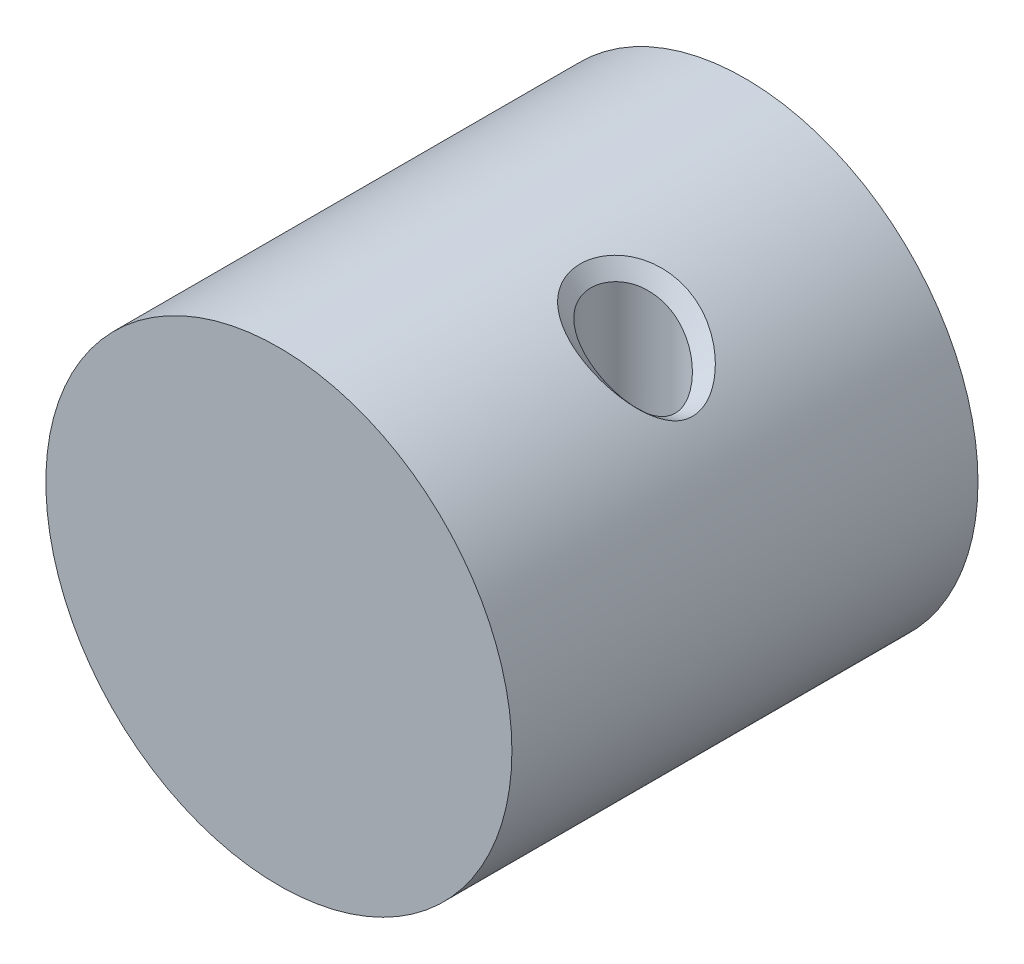
ISO-10303-21;
HEADER;
FILE_DESCRIPTION(('STEP AP214'),'2;1');
FILE_NAME('part.step','',(''),(''),'','','');
FILE_SCHEMA(('AUTOMOTIVE_DESIGN { 1 0 10303 214 1 1 1 1 }'));
ENDSEC;
DATA;
#1=APPLICATION_CONTEXT('core data for automotive mechanical design processes');
#2=APPLICATION_PROTOCOL_DEFINITION('international standard','automotive_design',2000,#1);
#3=PRODUCT_CONTEXT('',#1,'mechanical');
#4=PRODUCT('Part','Part','',(#3));
#5=PRODUCT_RELATED_PRODUCT_CATEGORY('part','',(#4));
#6=PRODUCT_DEFINITION_FORMATION('','',#4);
#7=PRODUCT_DEFINITION_CONTEXT('part definition',#1,'design');
#8=PRODUCT_DEFINITION('design','',#6,#7);
#9=PRODUCT_DEFINITION_SHAPE('','',#8);
#10=(LENGTH_UNIT() NAMED_UNIT(*) SI_UNIT(.MILLI.,.METRE.));
#11=(NAMED_UNIT(*) PLANE_ANGLE_UNIT() SI_UNIT($,.RADIAN.));
#12=(NAMED_UNIT(*) SI_UNIT($,.STERADIAN.) SOLID_ANGLE_UNIT());
#13=UNCERTAINTY_MEASURE_WITH_UNIT(LENGTH_MEASURE(1.E-05),#10,'distance_accuracy_value','');
#14=(GEOMETRIC_REPRESENTATION_CONTEXT(3) GLOBAL_UNCERTAINTY_ASSIGNED_CONTEXT((#13)) GLOBAL_UNIT_ASSIGNED_CONTEXT((#10,
#11,#12)) REPRESENTATION_CONTEXT('',''));
#15=CARTESIAN_POINT('',(0.,0.,0.));
#16=DIRECTION('',(0.,0.,1.));
#17=DIRECTION('',(1.,0.,0.));
#18=AXIS2_PLACEMENT_3D('',#15,#16,#17);
#19=CARTESIAN_POINT('',(0.,0.,25.));
#20=DIRECTION('',(0.,0.,-1.));
#21=DIRECTION('',(-1.,0.,0.));
#22=AXIS2_PLACEMENT_3D('',#19,#20,#21);
#23=CYLINDRICAL_SURFACE('',#22,25.);
#24=CARTESIAN_POINT('',(7.30974347389454,23.9074810539684,-1.24376962722106E-12));
#25=CARTESIAN_POINT('',(7.30997237631376,23.9074489383056,0.0870397648575998));
#26=CARTESIAN_POINT('',(7.32123338055778,23.9043034709858,0.52264136359775));
#27=CARTESIAN_POINT('',(7.44344578986285,23.8678399603276,1.39253136225855));
#28=CARTESIAN_POINT('',(7.85089980467598,23.7374933993846,2.55323139110753));
#29=CARTESIAN_POINT('',(8.54671682226728,23.498579120886,3.64869349988629));
#30=CARTESIAN_POINT('',(9.73966411055315,23.0430100764837,4.85972485626475));
#31=CARTESIAN_POINT('',(11.209666904177,22.3749055107022,5.61829197663956));
#32=CARTESIAN_POINT('',(12.7067551164635,21.5426808093991,5.92362472628961));
#33=CARTESIAN_POINT('',(13.8141062793869,20.8506369663582,5.94409809492801));
#34=CARTESIAN_POINT('',(14.8769847403961,20.1049025569509,5.77413626173053));
#35=CARTESIAN_POINT('',(15.8728467133326,19.3279248856483,5.42937652514873));
#36=CARTESIAN_POINT('',(16.784878474631,18.5396426797266,4.92363591809385));
#37=CARTESIAN_POINT('',(17.6043072601355,17.7616728164733,4.26327406903687));
#38=CARTESIAN_POINT('',(18.3123147244414,17.0282160079082,3.45039745312376));
#39=CARTESIAN_POINT('',(18.8855507499328,16.3868322107932,2.46029547781179));
#40=CARTESIAN_POINT('',(19.2934933996321,15.8998723149709,1.29961660346669));
#41=CARTESIAN_POINT('',(19.4092292344142,15.7574088157962,0.206099138749576));
#42=CARTESIAN_POINT('',(19.3574012672717,15.821089437367,-0.667258563429989));
#43=CARTESIAN_POINT('',(19.2511348847713,15.9499351921975,-1.30345965664715));
#44=CARTESIAN_POINT('',(19.0822860054682,16.1521258138773,-1.90275451782634));
#45=CARTESIAN_POINT('',(18.7851289334235,16.4994116252848,-2.64672215248969));
#46=CARTESIAN_POINT('',(18.3000442117225,17.0415254068003,-3.46235160000543));
#47=CARTESIAN_POINT('',(17.587119207816,17.778294995576,-4.27748174698293));
#48=CARTESIAN_POINT('',(16.7653194531404,18.5572859343365,-4.93554304195478));
#49=CARTESIAN_POINT('',(15.8515668608563,19.3456622093994,-5.44354824696945));
#50=CARTESIAN_POINT('',(14.8567782341363,20.119744531525,-5.78897588203163));
#51=CARTESIAN_POINT('',(13.7933461605968,20.8646312616614,-5.95111031519978));
#52=CARTESIAN_POINT('',(12.6812664193206,21.5573719787848,-5.9204383196832));
#53=CARTESIAN_POINT('',(11.5545598836946,22.1819820539428,-5.68226215537604));
#54=CARTESIAN_POINT('',(10.4472474271054,22.7224768581825,-5.22188408217247));
#55=CARTESIAN_POINT('',(9.4168926949122,23.1660704723504,-4.53055930557927));
#56=CARTESIAN_POINT('',(8.52631007092828,23.5063919735534,-3.627546765581));
#57=CARTESIAN_POINT('',(7.84400020171004,23.7397677836326,-2.53280636927204));
#58=CARTESIAN_POINT('',(7.43753548156944,23.8686113163364,-1.3837820937957));
#59=CARTESIAN_POINT('',(7.31858929434596,23.9046589116354,-0.521849834992076));
#60=CARTESIAN_POINT('',(7.30951457147532,23.9075131696311,-0.0870397648600858));
#61=CARTESIAN_POINT('',(7.30974347389454,23.9074810539684,-1.24376962722106E-12));
#62=B_SPLINE_CURVE_WITH_KNOTS('',3,(#24,#25,#26,#27,#28,#29,#30,#31,#32,#33,#34,#35,#36,#37,#38,
#39,#40,#41,#42,#43,#44,#45,#46,#47,#48,#49,#50,#51,#52,#53,#54,#55,#56,#57,#58,#59,#60,#61),
.UNSPECIFIED.,.T.,.F.,(4,1,1,1,1,1,1,1,1,1,1,1,1,1,1,1,1,1,1,1,1,1,1,1,1,1,1,1,1,1,1,1,1,1,1,4),
(0.,0.00625000000000009,0.03125,0.0625,0.09375,0.125,0.1875,0.21875,0.25,0.28125,0.3125,0.34375,
0.375,0.40625,0.4375,0.46875,0.5,0.515625,0.53125,0.546875,0.5625,0.59375,0.625,0.65625,0.6875,
0.71875,0.75,0.78125,0.8125,0.84375,0.875,0.90625,0.9375,0.96875,0.99375,1.),.UNSPECIFIED.);
#63=CARTESIAN_POINT('',(7.30974347389454,23.9074810539684,-1.24376962722106E-12));
#64=VERTEX_POINT('',#63);
#65=EDGE_CURVE('E56',#64,#64,#62,.F.);
#66=ORIENTED_EDGE('',*,*,#65,.T.);
#67=EDGE_LOOP('',(#66));
#68=FACE_BOUND('',#67,.T.);
#69=CARTESIAN_POINT('',(0.,0.,-25.));
#70=DIRECTION('',(0.,0.,1.));
#71=DIRECTION('',(1.,0.,0.));
#72=AXIS2_PLACEMENT_3D('',#69,#70,#71);
#73=CIRCLE('',#72,25.);
#74=CARTESIAN_POINT('',(25.,0.,-25.));
#75=VERTEX_POINT('',#74);
#76=EDGE_CURVE('E78',#75,#75,#73,.T.);
#77=ORIENTED_EDGE('',*,*,#76,.T.);
#78=EDGE_LOOP('',(#77));
#79=FACE_BOUND('',#78,.T.);
#80=CARTESIAN_POINT('',(0.,0.,25.));
#81=DIRECTION('',(0.,0.,1.));
#82=DIRECTION('',(1.,0.,0.));
#83=AXIS2_PLACEMENT_3D('',#80,#81,#82);
#84=CIRCLE('',#83,25.);
#85=CARTESIAN_POINT('',(25.,0.,25.));
#86=VERTEX_POINT('',#85);
#87=EDGE_CURVE('E73',#86,#86,#84,.T.);
#88=ORIENTED_EDGE('',*,*,#87,.F.);
#89=EDGE_LOOP('',(#88));
#90=FACE_BOUND('',#89,.T.);
#91=ADVANCED_FACE('F45',(#68,#79,#90),#23,.T.);
#92=CARTESIAN_POINT('',(0.,0.,25.));
#93=DIRECTION('',(0.,0.,1.));
#94=DIRECTION('',(1.,0.,0.));
#95=AXIS2_PLACEMENT_3D('',#92,#93,#94);
#96=PLANE('',#95);
#97=ORIENTED_EDGE('',*,*,#87,.T.);
#98=EDGE_LOOP('',(#97));
#99=FACE_BOUND('',#98,.T.);
#100=ADVANCED_FACE('F119',(#99),#96,.T.);
#101=CARTESIAN_POINT('',(0.,0.,-25.));
#102=DIRECTION('',(0.,0.,1.));
#103=DIRECTION('',(1.,0.,0.));
#104=AXIS2_PLACEMENT_3D('',#101,#102,#103);
#105=PLANE('',#104);
#106=ORIENTED_EDGE('',*,*,#76,.F.);
#107=EDGE_LOOP('',(#106));
#108=FACE_BOUND('',#107,.T.);
#109=ADVANCED_FACE('F118',(#108),#105,.F.);
#110=CARTESIAN_POINT('',(13.,0.,0.));
#111=DIRECTION('',(0.,1.,0.));
#112=DIRECTION('',(0.,0.,1.));
#113=AXIS2_PLACEMENT_3D('',#110,#111,#112);
#114=PLANE('',#113);
#115=CARTESIAN_POINT('',(13.,0.,0.));
#116=DIRECTION('',(0.,1.,0.));
#117=DIRECTION('',(0.,0.,1.));
#118=AXIS2_PLACEMENT_3D('',#115,#116,#117);
#119=CIRCLE('',#118,4.5);
#120=CARTESIAN_POINT('',(13.,0.,4.5));
#121=VERTEX_POINT('',#120);
#122=EDGE_CURVE('E66',#121,#121,#119,.T.);
#123=ORIENTED_EDGE('',*,*,#122,.T.);
#124=EDGE_LOOP('',(#123));
#125=FACE_BOUND('',#124,.T.);
#126=ADVANCED_FACE('F108',(#125),#114,.T.);
#127=CARTESIAN_POINT('',(13.,50.,0.));
#128=DIRECTION('',(0.,-1.,0.));
#129=DIRECTION('',(0.,0.,-1.));
#130=AXIS2_PLACEMENT_3D('',#127,#128,#129);
#131=CYLINDRICAL_SURFACE('',#130,4.5);
#132=CARTESIAN_POINT('',(8.5,22.2997278050381,9.47569659456166E-11));
#133=CARTESIAN_POINT('',(8.50026074510643,22.2997214324945,-0.0673114997222603));
#134=CARTESIAN_POINT('',(8.51009425155425,22.2964039345832,-0.404574444659071));
#135=CARTESIAN_POINT('',(8.6127308262808,22.2567806743789,-1.08166616192264));
#136=CARTESIAN_POINT('',(8.94203659366738,22.1168480063478,-1.99081504935145));
#137=CARTESIAN_POINT('',(9.47868169979536,21.8662944834,-2.85816728962487));
#138=CARTESIAN_POINT('',(10.1662895945261,21.5112564584609,-3.54520444669953));
#139=CARTESIAN_POINT('',(10.9542913744986,21.0655601765073,-4.04171840064922));
#140=CARTESIAN_POINT('',(11.7922148380865,20.5469874367108,-4.36293110546316));
#141=CARTESIAN_POINT('',(12.6184669398875,19.9758190229368,-4.50850152655662));
#142=CARTESIAN_POINT('',(13.4175703321254,19.3600645716021,-4.50352801745533));
#143=CARTESIAN_POINT('',(14.1819690557396,18.710158471296,-4.36459878462216));
#144=CARTESIAN_POINT('',(14.9052290455241,18.0541498183849,-4.10074366001933));
#145=CARTESIAN_POINT('',(15.5723434007278,17.3948633878245,-3.71893352670372));
#146=CARTESIAN_POINT('',(16.1702713773103,16.7484959382495,-3.22563601766325));
#147=CARTESIAN_POINT('',(16.6957970983322,16.1366414045896,-2.61195387624947));
#148=CARTESIAN_POINT('',(17.0579603326303,15.6972209620749,-1.98604263952447));
#149=CARTESIAN_POINT('',(17.2809804005135,15.4093711406675,-1.41277212388677));
#150=CARTESIAN_POINT('',(17.4085897303453,15.2391981981506,-0.950455794190515));
#151=CARTESIAN_POINT('',(17.4852730005658,15.1363332217353,-0.460083426964195));
#152=CARTESIAN_POINT('',(17.5147902036148,15.1022876627323,0.219739814326475));
#153=CARTESIAN_POINT('',(17.4111366536488,15.2449452826154,1.06443808393912));
#154=CARTESIAN_POINT('',(17.08959470529,15.6558419304743,1.94621947771917));
#155=CARTESIAN_POINT('',(16.6430882929585,16.1946578970715,2.68477022099446));
#156=CARTESIAN_POINT('',(16.1107717886495,16.8089584866172,3.28272066879391));
#157=CARTESIAN_POINT('',(15.5047740050962,17.4630550414957,3.76463086990335));
#158=CARTESIAN_POINT('',(14.8337112512853,18.124817169969,4.13322448684324));
#159=CARTESIAN_POINT('',(14.1067687622773,18.7852207348662,4.3843688363035));
#160=CARTESIAN_POINT('',(13.3357800939911,19.4283914639729,4.5114309617271));
#161=CARTESIAN_POINT('',(12.5265162632194,20.0406424698403,4.4996005620401));
#162=CARTESIAN_POINT('',(11.4250105198979,20.7943526289399,4.28295444640308));
#163=CARTESIAN_POINT('',(10.3397388230225,21.4307708753595,3.72523333836452));
#164=CARTESIAN_POINT('',(9.44013692705676,21.8829826972436,2.80893720516574));
#165=CARTESIAN_POINT('',(8.91152572274373,22.1250925678431,1.96947366654537));
#166=CARTESIAN_POINT('',(8.60096588439658,22.2583084307613,1.0722012438494));
#167=CARTESIAN_POINT('',(8.5067049509011,22.2965660859348,0.403712784913258));
#168=CARTESIAN_POINT('',(8.49973925489357,22.2997341775818,0.0673114999117754));
#169=CARTESIAN_POINT('',(8.5,22.2997278050381,9.47569659456166E-11));
#170=B_SPLINE_CURVE_WITH_KNOTS('',3,(#132,#133,#134,#135,#136,#137,#138,#139,#140,#141,#142,
#143,#144,#145,#146,#147,#148,#149,#150,#151,#152,#153,#154,#155,#156,#157,#158,#159,#160,#161,
#162,#163,#164,#165,#166,#167,#168,#169),.UNSPECIFIED.,.T.,.F.,(4,1,1,1,1,1,1,1,1,1,1,1,1,1,1,1,
1,1,1,1,1,1,1,1,1,1,1,1,1,1,1,1,1,1,1,4),(0.,0.00624999999999998,0.03125,0.0625,0.09375,0.125,
0.15625,0.1875,0.21875,0.25,0.28125,0.3125,0.34375,0.375,0.40625,0.4375,0.453125,0.46875,
0.484375,0.5,0.53125,0.5625,0.59375,0.625,0.65625,0.6875,0.71875,0.75,0.78125,0.8125,0.875,
0.90625,0.9375,0.96875,0.99375,1.),.UNSPECIFIED.);
#171=CARTESIAN_POINT('',(8.5,22.2997278050381,9.47569659456166E-11));
#172=VERTEX_POINT('',#171);
#173=EDGE_CURVE('E11',#172,#172,#170,.F.);
#174=ORIENTED_EDGE('',*,*,#173,.T.);
#175=EDGE_LOOP('',(#174));
#176=FACE_BOUND('',#175,.T.);
#177=ORIENTED_EDGE('',*,*,#122,.F.);
#178=EDGE_LOOP('',(#177));
#179=FACE_BOUND('',#178,.T.);
#180=ADVANCED_FACE('F98',(#176,#179),#131,.F.);
#181=CARTESIAN_POINT('',(8.5,22.2997278050381,9.47569659456166E-11));
#182=CARTESIAN_POINT('',(8.10324782463151,22.8356455546815,6.27567252721797E-11));
#183=CARTESIAN_POINT('',(7.70649564926303,23.371563304325,3.07564642699522E-11));
#184=CARTESIAN_POINT('',(7.30974347389454,23.9074810539684,-1.24376962722106E-12));
#185=CARTESIAN_POINT('',(8.49973925489357,22.2997341775818,0.0673114999117754));
#186=CARTESIAN_POINT('',(8.10315029536697,22.8356390978231,0.0738875882270502));
#187=CARTESIAN_POINT('',(7.70656133584037,23.3715440180643,0.080463676542325));
#188=CARTESIAN_POINT('',(7.30997237631376,23.9074489383056,0.0870397648575998));
#189=CARTESIAN_POINT('',(8.5067049509011,22.2965660859348,0.403712784913258));
#190=CARTESIAN_POINT('',(8.11154776078666,22.8324785476185,0.443355644474755));
#191=CARTESIAN_POINT('',(7.71639057067222,23.3683910093021,0.482998504036253));
#192=CARTESIAN_POINT('',(7.32123338055778,23.9043034709858,0.52264136359775));
#193=CARTESIAN_POINT('',(8.60096588439658,22.2583084307613,1.0722012438494));
#194=CARTESIAN_POINT('',(8.21512585288534,22.7948189406167,1.17897794998578));
#195=CARTESIAN_POINT('',(7.82928582137409,23.3313294504722,1.28575465612217));
#196=CARTESIAN_POINT('',(7.44344578986285,23.8678399603276,1.39253136225855));
#197=CARTESIAN_POINT('',(8.91152572274373,22.1250925678431,1.96947366654537));
#198=CARTESIAN_POINT('',(8.55798375005448,22.6625595116903,2.16405957473276));
#199=CARTESIAN_POINT('',(8.20444177736523,23.2000264555374,2.35864548292015));
#200=CARTESIAN_POINT('',(7.85089980467598,23.7374933993846,2.55323139110753));
#201=CARTESIAN_POINT('',(9.44013692705676,21.8829826972436,2.80893720516574));
#202=CARTESIAN_POINT('',(9.14233022546026,22.4215148384577,3.08885597007259));
#203=CARTESIAN_POINT('',(8.84452352386377,22.9600469796718,3.36877473497944));
#204=CARTESIAN_POINT('',(8.54671682226728,23.498579120886,3.64869349988629));
#205=CARTESIAN_POINT('',(10.3397388230225,21.4307708753595,3.72523333836452));
#206=CARTESIAN_POINT('',(10.1397139188661,21.9681839424009,4.1033971776646));
#207=CARTESIAN_POINT('',(9.93968901470961,22.5055970094423,4.48156101696468));
#208=CARTESIAN_POINT('',(9.73966411055315,23.0430100764837,4.85972485626475));
#209=CARTESIAN_POINT('',(11.4250105198979,20.7943526289399,4.28295444640308));
#210=CARTESIAN_POINT('',(11.3532293146576,21.3212035895274,4.72806695648191));
#211=CARTESIAN_POINT('',(11.2814481094173,21.8480545501148,5.17317946656074));
#212=CARTESIAN_POINT('',(11.209666904177,22.3749055107022,5.61829197663956));
#213=CARTESIAN_POINT('',(12.5265162632194,20.0406424698403,4.4996005620401));
#214=CARTESIAN_POINT('',(12.5865958809675,20.5413219163599,4.9742752834566));
#215=CARTESIAN_POINT('',(12.6466754987155,21.0420013628795,5.44895000487311));
#216=CARTESIAN_POINT('',(12.7067551164635,21.5426808093991,5.92362472628961));
#217=CARTESIAN_POINT('',(13.3357800939911,19.4283914639729,4.5114309617271));
#218=CARTESIAN_POINT('',(13.4952221557897,19.9024732981013,4.98898667279407));
#219=CARTESIAN_POINT('',(13.6546642175883,20.3765551322298,5.46654238386104));
#220=CARTESIAN_POINT('',(13.8141062793869,20.8506369663582,5.94409809492801));
#221=CARTESIAN_POINT('',(14.1067687622773,18.7852207348662,4.3843688363035));
#222=CARTESIAN_POINT('',(14.3635074216502,19.2251146755611,4.84762464477917));
#223=CARTESIAN_POINT('',(14.6202460810232,19.665008616256,5.31088045325485));
#224=CARTESIAN_POINT('',(14.8769847403961,20.1049025569509,5.77413626173053));
#225=CARTESIAN_POINT('',(14.8337112512853,18.124817169969,4.13322448684324));
#226=CARTESIAN_POINT('',(15.1800897386344,18.5258530751954,4.5652751662784));
#227=CARTESIAN_POINT('',(15.5264682259835,18.9268889804218,4.99732584571356));
#228=CARTESIAN_POINT('',(15.8728467133326,19.3279248856483,5.42937652514873));
#229=CARTESIAN_POINT('',(15.5047740050962,17.4630550414957,3.76463086990335));
#230=CARTESIAN_POINT('',(15.9314754949411,17.8219175875727,4.15096588596685));
#231=CARTESIAN_POINT('',(16.3581769847861,18.1807801336496,4.53730090203035));
#232=CARTESIAN_POINT('',(16.784878474631,18.5396426797266,4.92363591809385));
#233=CARTESIAN_POINT('',(16.1107717886495,16.8089584866172,3.28272066879391));
#234=CARTESIAN_POINT('',(16.6086169458115,17.1265299299026,3.60957180220823));
#235=CARTESIAN_POINT('',(17.1064621029735,17.4441013731879,3.93642293562255));
#236=CARTESIAN_POINT('',(17.6043072601355,17.7616728164733,4.26327406903687));
#237=CARTESIAN_POINT('',(16.6430882929585,16.1946578970715,2.68477022099446));
#238=CARTESIAN_POINT('',(17.1994971034528,16.4725106006837,2.93997929837089));
#239=CARTESIAN_POINT('',(17.7559059139471,16.7503633042959,3.19518837574732));
#240=CARTESIAN_POINT('',(18.3123147244414,17.0282160079082,3.45039745312376));
#241=CARTESIAN_POINT('',(17.08959470529,15.6558419304743,1.94621947771917));
#242=CARTESIAN_POINT('',(17.688246720171,15.8995053572473,2.11757814441671));
#243=CARTESIAN_POINT('',(18.2868987350519,16.1431687840202,2.28893681111425));
#244=CARTESIAN_POINT('',(18.8855507499328,16.3868322107932,2.46029547781179));
#245=CARTESIAN_POINT('',(17.4111366536488,15.2449452826154,1.06443808393912));
#246=CARTESIAN_POINT('',(18.0385889023099,15.4632542934006,1.14283092378164));
#247=CARTESIAN_POINT('',(18.666041150971,15.6815633041857,1.22122376362416));
#248=CARTESIAN_POINT('',(19.2934933996321,15.8998723149709,1.29961660346669));
#249=CARTESIAN_POINT('',(17.5147902036148,15.1022876627323,0.219739814326475));
#250=CARTESIAN_POINT('',(18.1462698805479,15.3206613804203,0.215192922467509));
#251=CARTESIAN_POINT('',(18.7777495574811,15.5390350981082,0.210646030608543));
#252=CARTESIAN_POINT('',(19.4092292344142,15.7574088157962,0.206099138749576));
#253=CARTESIAN_POINT('',(17.4852730005658,15.1363332217353,-0.460083426964195));
#254=CARTESIAN_POINT('',(18.1093157561344,15.3645852936126,-0.529141805786126));
#255=CARTESIAN_POINT('',(18.733358511703,15.5928373654898,-0.598200184608058));
#256=CARTESIAN_POINT('',(19.3574012672717,15.821089437367,-0.667258563429989));
#257=CARTESIAN_POINT('',(17.4085897303453,15.2391981981506,-0.950455794190515));
#258=CARTESIAN_POINT('',(18.0227714484873,15.4761105294996,-1.06812374834273));
#259=CARTESIAN_POINT('',(18.6369531666293,15.7130228608485,-1.18579170249494));
#260=CARTESIAN_POINT('',(19.2511348847713,15.9499351921975,-1.30345965664715));
#261=CARTESIAN_POINT('',(17.2809804005135,15.4093711406675,-1.41277212388677));
#262=CARTESIAN_POINT('',(17.8814156021651,15.6569560317374,-1.57609958853329));
#263=CARTESIAN_POINT('',(18.4818508038166,15.9045409228074,-1.73942705317982));
#264=CARTESIAN_POINT('',(19.0822860054682,16.1521258138773,-1.90275451782634));
#265=CARTESIAN_POINT('',(17.0579603326303,15.6972209620749,-1.98604263952447));
#266=CARTESIAN_POINT('',(17.6336831995614,15.9646178498116,-2.20626914384621));
#267=CARTESIAN_POINT('',(18.2094060664924,16.2320147375482,-2.42649564816795));
#268=CARTESIAN_POINT('',(18.7851289334235,16.4994116252848,-2.64672215248969));
#269=CARTESIAN_POINT('',(16.6957970983322,16.1366414045896,-2.61195387624947));
#270=CARTESIAN_POINT('',(17.230546136129,16.4382694053265,-2.89541978416812));
#271=CARTESIAN_POINT('',(17.7652951739257,16.7398974060634,-3.17888569208678));
#272=CARTESIAN_POINT('',(18.3000442117225,17.0415254068003,-3.46235160000543));
#273=CARTESIAN_POINT('',(16.1702713773103,16.7484959382495,-3.22563601766325));
#274=CARTESIAN_POINT('',(16.6425539874789,17.0917622906917,-3.57625126076981));
#275=CARTESIAN_POINT('',(17.1148365976475,17.4350286431338,-3.92686650387637));
#276=CARTESIAN_POINT('',(17.587119207816,17.778294995576,-4.27748174698293));
#277=CARTESIAN_POINT('',(15.5723434007278,17.3948633878245,-3.71893352670372));
#278=CARTESIAN_POINT('',(15.9700020848653,17.7823375699952,-4.12447003178741));
#279=CARTESIAN_POINT('',(16.3676607690029,18.1698117521658,-4.5300065368711));
#280=CARTESIAN_POINT('',(16.7653194531404,18.5572859343365,-4.93554304195478));
#281=CARTESIAN_POINT('',(14.9052290455241,18.0541498183849,-4.10074366001933));
#282=CARTESIAN_POINT('',(15.2206749839682,18.4846539487231,-4.5483451890027));
#283=CARTESIAN_POINT('',(15.5361209224122,18.9151580790613,-4.99594671798607));
#284=CARTESIAN_POINT('',(15.8515668608563,19.3456622093994,-5.44354824696945));
#285=CARTESIAN_POINT('',(14.1819690557396,18.710158471296,-4.36459878462216));
#286=CARTESIAN_POINT('',(14.4069054485385,19.1800204913723,-4.83939115042532));
#287=CARTESIAN_POINT('',(14.6318418413374,19.6498825114487,-5.31418351622847));
#288=CARTESIAN_POINT('',(14.8567782341363,20.119744531525,-5.78897588203163));
#289=CARTESIAN_POINT('',(13.4175703321254,19.3600645716021,-4.50352801745533));
#290=CARTESIAN_POINT('',(13.5428289416159,19.8615868016218,-4.98605545003682));
#291=CARTESIAN_POINT('',(13.6680875511063,20.3631090316416,-5.4685828826183));
#292=CARTESIAN_POINT('',(13.7933461605968,20.8646312616614,-5.95111031519978));
#293=CARTESIAN_POINT('',(12.6184669398875,19.9758190229368,-4.50850152655662));
#294=CARTESIAN_POINT('',(12.6394000996985,20.5030033415528,-4.97914712426548));
#295=CARTESIAN_POINT('',(12.6603332595096,21.0301876601688,-5.44979272197434));
#296=CARTESIAN_POINT('',(12.6812664193206,21.5573719787848,-5.9204383196832));
#297=CARTESIAN_POINT('',(11.7922148380865,20.5469874367108,-4.36293110546316));
#298=CARTESIAN_POINT('',(11.7129965199559,21.0919856424548,-4.80270812210079));
#299=CARTESIAN_POINT('',(11.6337782018252,21.6369838481988,-5.24248513873841));
#300=CARTESIAN_POINT('',(11.5545598836946,22.1819820539428,-5.68226215537604));
#301=CARTESIAN_POINT('',(10.9542913744986,21.0655601765073,-4.04171840064922));
#302=CARTESIAN_POINT('',(10.7852767253675,21.6178657370657,-4.43510696115697));
#303=CARTESIAN_POINT('',(10.6162620762365,22.1701712976241,-4.82849552166472));
#304=CARTESIAN_POINT('',(10.4472474271054,22.7224768581825,-5.22188408217247));
#305=CARTESIAN_POINT('',(10.1662895945261,21.5112564584609,-3.54520444669953));
#306=CARTESIAN_POINT('',(9.91649062798811,22.0628611297574,-3.87365606632611));
#307=CARTESIAN_POINT('',(9.66669166145016,22.6144658010539,-4.20210768595269));
#308=CARTESIAN_POINT('',(9.4168926949122,23.1660704723504,-4.53055930557927));
#309=CARTESIAN_POINT('',(9.47868169979536,21.8662944834,-2.85816728962487));
#310=CARTESIAN_POINT('',(9.161224490173,22.4129936467845,-3.11462711494358));
#311=CARTESIAN_POINT('',(8.84376728055064,22.959692810169,-3.37108694026229));
#312=CARTESIAN_POINT('',(8.52631007092828,23.5063919735534,-3.627546765581));
#313=CARTESIAN_POINT('',(8.94203659366738,22.1168480063478,-1.99081504935145));
#314=CARTESIAN_POINT('',(8.57602446301494,22.6578212654427,-2.17147882265831));
#315=CARTESIAN_POINT('',(8.21001233236249,23.1987945245377,-2.35214259596518));
#316=CARTESIAN_POINT('',(7.84400020171004,23.7397677836326,-2.53280636927204));
#317=CARTESIAN_POINT('',(8.6127308262808,22.2567806743789,-1.08166616192264));
#318=CARTESIAN_POINT('',(8.22099904471034,22.7940575550314,-1.182371472547));
#319=CARTESIAN_POINT('',(7.82926726313989,23.3313344356839,-1.28307678317135));
#320=CARTESIAN_POINT('',(7.43753548156944,23.8686113163364,-1.3837820937957));
#321=CARTESIAN_POINT('',(8.51009425155425,22.2964039345832,-0.404574444659071));
#322=CARTESIAN_POINT('',(8.11292593248482,22.8324889269339,-0.443666241436739));
#323=CARTESIAN_POINT('',(7.71575761341539,23.3685739192847,-0.482758038214408));
#324=CARTESIAN_POINT('',(7.31858929434596,23.9046589116354,-0.521849834992076));
#325=CARTESIAN_POINT('',(8.50026074510643,22.2997214324945,-0.0673114997222603));
#326=CARTESIAN_POINT('',(8.10334535389606,22.83565201154,-0.0738875881015355));
#327=CARTESIAN_POINT('',(7.70642996268569,23.3715825905856,-0.0804636764808106));
#328=CARTESIAN_POINT('',(7.30951457147532,23.9075131696311,-0.0870397648600858));
#329=CARTESIAN_POINT('',(8.5,22.2997278050381,9.47569659456166E-11));
#330=CARTESIAN_POINT('',(8.10324782463151,22.8356455546815,6.27567252721797E-11));
#331=CARTESIAN_POINT('',(7.70649564926303,23.371563304325,3.07564642699522E-11));
#332=CARTESIAN_POINT('',(7.30974347389454,23.9074810539684,-1.24376962722106E-12));
#333=B_SPLINE_SURFACE_WITH_KNOTS('',3,3,((#181,#182,#183,#184),(#185,#186,#187,#188),(#189,#190,
#191,#192),(#193,#194,#195,#196),(#197,#198,#199,#200),(#201,#202,#203,#204),(#205,#206,#207,
#208),(#209,#210,#211,#212),(#213,#214,#215,#216),(#217,#218,#219,#220),(#221,#222,#223,#224),
(#225,#226,#227,#228),(#229,#230,#231,#232),(#233,#234,#235,#236),(#237,#238,#239,#240),(#241,
#242,#243,#244),(#245,#246,#247,#248),(#249,#250,#251,#252),(#253,#254,#255,#256),(#257,#258,
#259,#260),(#261,#262,#263,#264),(#265,#266,#267,#268),(#269,#270,#271,#272),(#273,#274,#275,
#276),(#277,#278,#279,#280),(#281,#282,#283,#284),(#285,#286,#287,#288),(#289,#290,#291,#292),
(#293,#294,#295,#296),(#297,#298,#299,#300),(#301,#302,#303,#304),(#305,#306,#307,#308),(#309,
#310,#311,#312),(#313,#314,#315,#316),(#317,#318,#319,#320),(#321,#322,#323,#324),(#325,#326,
#327,#328),(#329,#330,#331,#332)),.UNSPECIFIED.,.T.,.F.,.F.,(4,1,1,1,1,1,1,1,1,1,1,1,1,1,1,1,1,
1,1,1,1,1,1,1,1,1,1,1,1,1,1,1,1,1,1,4),(4,4),(0.,0.00625000000000009,0.03125,0.0625,0.09375,
0.125,0.1875,0.21875,0.25,0.28125,0.3125,0.34375,0.375,0.40625,0.4375,0.46875,0.5,0.515625,
0.53125,0.546875,0.5625,0.59375,0.625,0.65625,0.6875,0.71875,0.75,0.78125,0.8125,0.84375,0.875,
0.90625,0.9375,0.96875,0.99375,1.),(0.,1.),.UNSPECIFIED.);
#334=ORIENTED_EDGE('',*,*,#173,.F.);
#335=EDGE_LOOP('',(#334));
#336=FACE_BOUND('',#335,.T.);
#337=ORIENTED_EDGE('',*,*,#65,.F.);
#338=EDGE_LOOP('',(#337));
#339=FACE_BOUND('',#338,.T.);
#340=ADVANCED_FACE('F87',(#336,#339),#333,.F.);
#341=CLOSED_SHELL('',(#91,#100,#109,#126,#180,#340));
#342=MANIFOLD_SOLID_BREP('B2',#341);
#343=ADVANCED_BREP_SHAPE_REPRESENTATION('',(#18,#342),#14);
#344=SHAPE_DEFINITION_REPRESENTATION(#9,#343);
ENDSEC;
END-ISO-10303-21;
